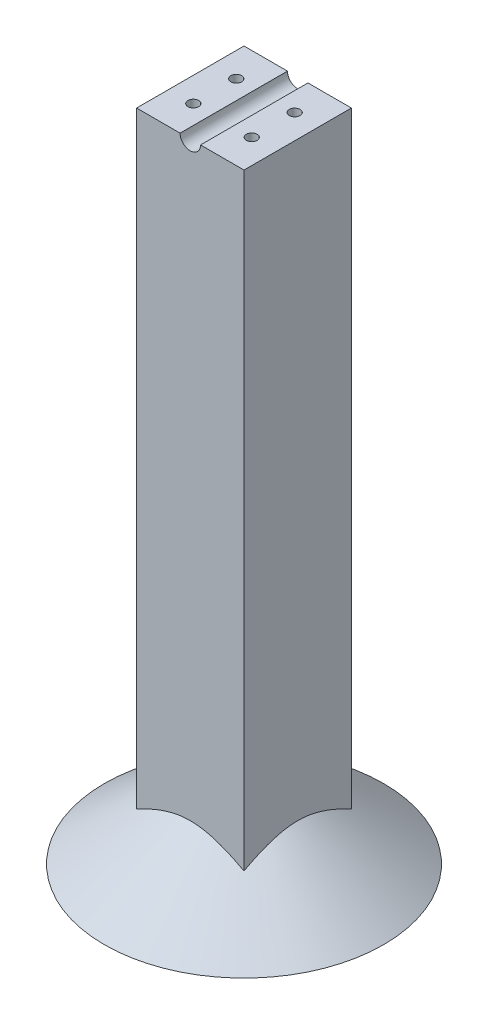
ISO-10303-21;
HEADER;
FILE_DESCRIPTION(('STEP AP214'),'2;1');
FILE_NAME('part.step','',(''),(''),'','','');
FILE_SCHEMA(('AUTOMOTIVE_DESIGN { 1 0 10303 214 1 1 1 1 }'));
ENDSEC;
DATA;
#1=APPLICATION_CONTEXT('core data for automotive mechanical design processes');
#2=APPLICATION_PROTOCOL_DEFINITION('international standard','automotive_design',2000,#1);
#3=PRODUCT_CONTEXT('',#1,'mechanical');
#4=PRODUCT('Part','Part','',(#3));
#5=PRODUCT_RELATED_PRODUCT_CATEGORY('part','',(#4));
#6=PRODUCT_DEFINITION_FORMATION('','',#4);
#7=PRODUCT_DEFINITION_CONTEXT('part definition',#1,'design');
#8=PRODUCT_DEFINITION('design','',#6,#7);
#9=PRODUCT_DEFINITION_SHAPE('','',#8);
#10=(LENGTH_UNIT() NAMED_UNIT(*) SI_UNIT(.MILLI.,.METRE.));
#11=(NAMED_UNIT(*) PLANE_ANGLE_UNIT() SI_UNIT($,.RADIAN.));
#12=(NAMED_UNIT(*) SI_UNIT($,.STERADIAN.) SOLID_ANGLE_UNIT());
#13=UNCERTAINTY_MEASURE_WITH_UNIT(LENGTH_MEASURE(1.E-05),#10,'distance_accuracy_value','');
#14=(GEOMETRIC_REPRESENTATION_CONTEXT(3) GLOBAL_UNCERTAINTY_ASSIGNED_CONTEXT((#13)) GLOBAL_UNIT_ASSIGNED_CONTEXT((#10,
#11,#12)) REPRESENTATION_CONTEXT('',''));
#15=CARTESIAN_POINT('',(0.,0.,0.));
#16=DIRECTION('',(0.,0.,1.));
#17=DIRECTION('',(1.,0.,0.));
#18=AXIS2_PLACEMENT_3D('',#15,#16,#17);
#19=CARTESIAN_POINT('',(0.,0.,0.));
#20=DIRECTION('',(0.,1.,0.));
#21=DIRECTION('',(0.,0.,1.));
#22=AXIS2_PLACEMENT_3D('',#19,#20,#21);
#23=PLANE('',#22);
#24=CARTESIAN_POINT('',(-6.8,0.,5.));
#25=DIRECTION('',(0.,1.,0.));
#26=DIRECTION('',(0.,0.,1.));
#27=AXIS2_PLACEMENT_3D('',#24,#25,#26);
#28=CIRCLE('',#27,1.25);
#29=CARTESIAN_POINT('',(-6.8,0.,6.25));
#30=VERTEX_POINT('',#29);
#31=EDGE_CURVE('E113',#30,#30,#28,.T.);
#32=ORIENTED_EDGE('',*,*,#31,.F.);
#33=EDGE_LOOP('',(#32));
#34=FACE_BOUND('',#33,.T.);
#35=CARTESIAN_POINT('',(-6.8,0.,-5.));
#36=DIRECTION('',(0.,1.,0.));
#37=DIRECTION('',(0.,0.,1.));
#38=AXIS2_PLACEMENT_3D('',#35,#36,#37);
#39=CIRCLE('',#38,1.25);
#40=CARTESIAN_POINT('',(-6.8,0.,-3.75));
#41=VERTEX_POINT('',#40);
#42=EDGE_CURVE('E112',#41,#41,#39,.T.);
#43=ORIENTED_EDGE('',*,*,#42,.F.);
#44=EDGE_LOOP('',(#43));
#45=FACE_BOUND('',#44,.T.);
#46=DIRECTION('',(0.,0.,1.));
#47=VECTOR('',#46,1.);
#48=CARTESIAN_POINT('',(-2.38125,0.,-32.501));
#49=LINE('',#48,#47);
#50=CARTESIAN_POINT('',(-2.38125,0.,12.5));
#51=VERTEX_POINT('',#50);
#52=CARTESIAN_POINT('',(-2.38125,0.,-12.5));
#53=VERTEX_POINT('',#52);
#54=EDGE_CURVE('E54',#51,#53,#49,.F.);
#55=ORIENTED_EDGE('',*,*,#54,.T.);
#56=DIRECTION('',(-1.,0.,0.));
#57=VECTOR('',#56,1.);
#58=CARTESIAN_POINT('',(-12.5,0.,-12.5));
#59=LINE('',#58,#57);
#60=CARTESIAN_POINT('',(-12.5,0.,-12.5));
#61=VERTEX_POINT('',#60);
#62=EDGE_CURVE('E195',#53,#61,#59,.T.);
#63=ORIENTED_EDGE('',*,*,#62,.T.);
#64=DIRECTION('',(0.,0.,1.));
#65=VECTOR('',#64,1.);
#66=CARTESIAN_POINT('',(-12.5,0.,-12.5));
#67=LINE('',#66,#65);
#68=CARTESIAN_POINT('',(-12.5,0.,12.5));
#69=VERTEX_POINT('',#68);
#70=EDGE_CURVE('E208',#61,#69,#67,.T.);
#71=ORIENTED_EDGE('',*,*,#70,.T.);
#72=DIRECTION('',(1.,0.,0.));
#73=VECTOR('',#72,1.);
#74=CARTESIAN_POINT('',(-12.5,0.,12.5));
#75=LINE('',#74,#73);
#76=EDGE_CURVE('E198',#69,#51,#75,.T.);
#77=ORIENTED_EDGE('',*,*,#76,.T.);
#78=EDGE_LOOP('',(#55,#63,#71,#77));
#79=FACE_BOUND('',#78,.T.);
#80=ADVANCED_FACE('F33',(#34,#45,#79),#23,.T.);
#81=CARTESIAN_POINT('',(0.,-152.4,0.));
#82=DIRECTION('',(0.,1.,0.));
#83=DIRECTION('',(0.,0.,1.));
#84=AXIS2_PLACEMENT_3D('',#81,#82,#83);
#85=PLANE('',#84);
#86=CARTESIAN_POINT('',(0.,-152.4,0.));
#87=DIRECTION('',(0.,-1.,0.));
#88=DIRECTION('',(1.,0.,0.));
#89=AXIS2_PLACEMENT_3D('',#86,#87,#88);
#90=CIRCLE('',#89,32.5);
#91=CARTESIAN_POINT('',(32.5,-152.4,0.));
#92=VERTEX_POINT('',#91);
#93=EDGE_CURVE('E144',#92,#92,#90,.T.);
#94=ORIENTED_EDGE('',*,*,#93,.T.);
#95=EDGE_LOOP('',(#94));
#96=FACE_BOUND('',#95,.T.);
#97=ADVANCED_FACE('F182',(#96),#85,.F.);
#98=CARTESIAN_POINT('',(0.,-152.4,0.));
#99=DIRECTION('',(0.,-1.,0.));
#100=DIRECTION('',(1.,0.,0.));
#101=AXIS2_PLACEMENT_3D('',#98,#99,#100);
#102=CONICAL_SURFACE('',#101,32.5,0.927295218001613);
#103=CARTESIAN_POINT('',(-26.2243010295689,-149.813293417001,-12.5));
#104=CARTESIAN_POINT('',(-25.6187512116304,-149.403376552686,-12.5));
#105=CARTESIAN_POINT('',(-25.0120225593732,-148.995186626278,-12.5));
#106=CARTESIAN_POINT('',(-23.7956278677155,-148.183179999635,-12.5));
#107=CARTESIAN_POINT('',(-23.1859617631345,-147.779363397094,-12.5));
#108=CARTESIAN_POINT('',(-21.9616062426003,-146.976035189606,-12.5));
#109=CARTESIAN_POINT('',(-21.3469080638742,-146.576536918876,-12.5));
#110=CARTESIAN_POINT('',(-20.1132289532189,-145.784176594127,-12.5));
#111=CARTESIAN_POINT('',(-19.494247956235,-145.391314641224,-12.5));
#112=CARTESIAN_POINT('',(-18.1998631925214,-144.581950567522,-12.5));
#113=CARTESIAN_POINT('',(-17.5240101446196,-144.166165430351,-12.5));
#114=CARTESIAN_POINT('',(-16.1645880498756,-143.347399644077,-12.5));
#115=CARTESIAN_POINT('',(-15.481019345862,-142.944418429071,-12.5));
#116=CARTESIAN_POINT('',(-14.448669543169,-142.353044747635,-12.5));
#117=CARTESIAN_POINT('',(-14.1035788935266,-142.158206969668,-12.5));
#118=CARTESIAN_POINT('',(-13.410615276582,-141.773549977645,-12.5));
#119=CARTESIAN_POINT('',(-13.0627423671592,-141.583730659542,-12.5));
#120=CARTESIAN_POINT('',(-12.3637465546641,-141.209909997568,-12.5));
#121=CARTESIAN_POINT('',(-12.0126227234552,-141.025910385861,-12.5));
#122=CARTESIAN_POINT('',(-11.3068250622317,-140.664840633347,-12.5));
#123=CARTESIAN_POINT('',(-10.9521512661581,-140.487770426368,-12.5));
#124=CARTESIAN_POINT('',(-10.2449580051148,-140.144815859692,-12.5));
#125=CARTESIAN_POINT('',(-9.8925067099828,-139.97879133725,-12.5));
#126=CARTESIAN_POINT('',(-9.18329902465731,-139.656131388694,-12.5));
#127=CARTESIAN_POINT('',(-8.82654246116981,-139.499496342045,-12.5));
#128=CARTESIAN_POINT('',(-8.10850898288185,-139.197473248927,-12.5));
#129=CARTESIAN_POINT('',(-7.7472346546791,-139.05207908093,-12.5));
#130=CARTESIAN_POINT('',(-7.01965331642115,-138.774555219264,-12.5));
#131=CARTESIAN_POINT('',(-6.65334699798655,-138.642423723043,-12.5));
#132=CARTESIAN_POINT('',(-5.92364415918834,-138.396599989365,-12.5));
#133=CARTESIAN_POINT('',(-5.56036469907021,-138.282562462058,-12.5));
#134=CARTESIAN_POINT('',(-4.82871848674797,-138.071989744562,-12.5));
#135=CARTESIAN_POINT('',(-4.46035164192054,-137.975454873487,-12.5));
#136=CARTESIAN_POINT('',(-3.71922708738284,-137.802617718969,-12.5));
#137=CARTESIAN_POINT('',(-3.34647383691921,-137.726296477168,-12.5));
#138=CARTESIAN_POINT('',(-2.59703764339054,-137.596300581269,-12.5));
#139=CARTESIAN_POINT('',(-2.22035532546225,-137.5426223792,-12.5));
#140=CARTESIAN_POINT('',(-1.5657484281248,-137.471029043301,-12.5));
#141=CARTESIAN_POINT('',(-1.28844257018611,-137.447382698575,-12.5));
#142=CARTESIAN_POINT('',(-0.733004832204488,-137.41381118692,-12.5));
#143=CARTESIAN_POINT('',(-0.454873001700603,-137.403885213105,-12.5));
#144=CARTESIAN_POINT('',(0.101523565876558,-137.397987530731,-12.5));
#145=CARTESIAN_POINT('',(0.379788295463824,-137.402015111884,-12.5));
#146=CARTESIAN_POINT('',(0.935773745675558,-137.423927493208,-12.5));
#147=CARTESIAN_POINT('',(1.21349445518911,-137.441812573501,-12.5));
#148=CARTESIAN_POINT('',(1.76953708093603,-137.491192788868,-12.5));
#149=CARTESIAN_POINT('',(2.04785115151611,-137.522775721608,-12.5));
#150=CARTESIAN_POINT('',(2.60270734078541,-137.59888068357,-12.5));
#151=CARTESIAN_POINT('',(2.87924936477604,-137.6434033985,-12.5));
#152=CARTESIAN_POINT('',(3.43014486478779,-137.744506420731,-12.5));
#153=CARTESIAN_POINT('',(3.70449806932452,-137.801088200347,-12.5));
#154=CARTESIAN_POINT('',(4.2506787965993,-137.925299220085,-12.5));
#155=CARTESIAN_POINT('',(4.52250623576825,-137.992928824377,-12.5));
#156=CARTESIAN_POINT('',(5.3725184815032,-138.22116959061,-12.5));
#157=CARTESIAN_POINT('',(5.94592236930663,-138.399739499594,-12.5));
#158=CARTESIAN_POINT('',(7.08031212499417,-138.792849422449,-12.5));
#159=CARTESIAN_POINT('',(7.64129099825037,-139.007409141905,-12.5));
#160=CARTESIAN_POINT('',(8.75292528656359,-139.464584723849,-12.5));
#161=CARTESIAN_POINT('',(9.30355741623722,-139.707256692855,-12.5));
#162=CARTESIAN_POINT('',(10.3947837859339,-140.213779384715,-12.5));
#163=CARTESIAN_POINT('',(10.9353797820099,-140.477626358678,-12.5));
#164=CARTESIAN_POINT('',(12.0179456868848,-141.026616792678,-12.5));
#165=CARTESIAN_POINT('',(12.5597629721002,-141.312059529576,-12.5));
#166=CARTESIAN_POINT('',(13.6362328728646,-141.896124992603,-12.5));
#167=CARTESIAN_POINT('',(14.1708852732594,-142.194748113375,-12.5));
#168=CARTESIAN_POINT('',(15.2335461330669,-142.801954283345,-12.5));
#169=CARTESIAN_POINT('',(15.7615624690208,-143.110523586742,-12.5));
#170=CARTESIAN_POINT('',(16.5498850503547,-143.579558933012,-12.5));
#171=CARTESIAN_POINT('',(16.8120395703601,-143.736932624097,-12.5));
#172=CARTESIAN_POINT('',(17.3352237014495,-144.05353868284,-12.5));
#173=CARTESIAN_POINT('',(17.5962533139833,-144.2127710481,-12.5));
#174=CARTESIAN_POINT('',(18.3937814834394,-144.702784494311,-12.5));
#175=CARTESIAN_POINT('',(18.9286167664688,-145.036274191027,-12.5));
#176=CARTESIAN_POINT('',(19.994663541332,-145.709002639267,-12.5));
#177=CARTESIAN_POINT('',(20.5258749706794,-146.048241489574,-12.5));
#178=CARTESIAN_POINT('',(21.585280960242,-146.731468115516,-12.5));
#179=CARTESIAN_POINT('',(22.1134753227495,-147.075456197433,-12.5));
#180=CARTESIAN_POINT('',(23.1672792042188,-147.767359321987,-12.5));
#181=CARTESIAN_POINT('',(23.6928887361757,-148.115274344854,-12.5));
#182=CARTESIAN_POINT('',(24.7420235450092,-148.814478092265,-12.5));
#183=CARTESIAN_POINT('',(25.2655483409483,-149.165767537957,-12.5));
#184=CARTESIAN_POINT('',(26.3107101628304,-149.87114469359,-12.5));
#185=CARTESIAN_POINT('',(26.8323471829574,-150.225232412141,-12.5));
#186=CARTESIAN_POINT('',(28.3948353437132,-151.291064819705,-12.5));
#187=CARTESIAN_POINT('',(29.4332561382384,-152.006373780035,-12.5));
#188=CARTESIAN_POINT('',(30.987880793138,-153.085107365635,-12.5));
#189=CARTESIAN_POINT('',(31.505926814931,-153.445885517054,-12.5));
#190=CARTESIAN_POINT('',(32.540927011479,-154.168997982742,-12.5));
#191=CARTESIAN_POINT('',(33.0578811934971,-154.531332286609,-12.5));
#192=CARTESIAN_POINT('',(34.6073215985525,-155.620378925845,-12.5));
#193=CARTESIAN_POINT('',(35.6383760411644,-156.349128289092,-12.5));
#194=CARTESIAN_POINT('',(37.6973348210738,-157.810755974206,-12.5));
#195=CARTESIAN_POINT('',(38.7252395778549,-158.543633705736,-12.5));
#196=CARTESIAN_POINT('',(40.7786318875631,-160.012761068068,-12.5));
#197=CARTESIAN_POINT('',(41.8041194461696,-160.749010690934,-12.5));
#198=CARTESIAN_POINT('',(44.6468585445529,-162.795660326505,-12.5));
#199=CARTESIAN_POINT('',(46.4620128847816,-164.108972754611,-12.5));
#200=CARTESIAN_POINT('',(50.0880221968464,-166.741672074124,-12.5));
#201=CARTESIAN_POINT('',(51.8988769853552,-168.061059217742,-12.5));
#202=CARTESIAN_POINT('',(55.5135941439043,-170.701526953499,-12.5));
#203=CARTESIAN_POINT('',(57.3174632269076,-172.022598358603,-12.5));
#204=CARTESIAN_POINT('',(60.0213844907413,-174.006680293497,-12.5));
#205=CARTESIAN_POINT('',(60.9223566757276,-174.668437810542,-12.5));
#206=CARTESIAN_POINT('',(62.7237573247778,-175.992691809218,-12.5));
#207=CARTESIAN_POINT('',(63.6241857890416,-176.655188290576,-12.5));
#208=CARTESIAN_POINT('',(64.5243774932075,-177.31800636118,-12.5));
#209=B_SPLINE_CURVE_WITH_KNOTS('',3,(#103,#104,#105,#106,#107,#108,#109,#110,#111,#112,#113,
#114,#115,#116,#117,#118,#119,#120,#121,#122,#123,#124,#125,#126,#127,#128,#129,#130,#131,#132,
#133,#134,#135,#136,#137,#138,#139,#140,#141,#142,#143,#144,#145,#146,#147,#148,#149,#150,#151,
#152,#153,#154,#155,#156,#157,#158,#159,#160,#161,#162,#163,#164,#165,#166,#167,#168,#169,#170,
#171,#172,#173,#174,#175,#176,#177,#178,#179,#180,#181,#182,#183,#184,#185,#186,#187,#188,#189,
#190,#191,#192,#193,#194,#195,#196,#197,#198,#199,#200,#201,#202,#203,#204,#205,#206,#207,#208),
.UNSPECIFIED.,.F.,.F.,(4,2,2,2,2,2,2,2,2,2,2,2,2,2,2,2,2,2,2,2,2,2,2,2,2,2,2,2,2,2,2,2,2,2,2,2,
2,2,2,2,2,2,2,2,2,2,2,2,2,2,2,2,4),(0.,2.19375066545931,4.38755023532075,6.58685090202919,
8.78618504907016,11.1666102207505,13.5469300364471,14.7357805006485,15.9246062971454,
17.1137826652816,18.302947674619,19.4716238522745,20.6403472289768,21.808429595647,
22.9763529907109,24.1182501180169,25.2601680627207,26.4010111794304,27.5416754693516,
28.3762996682862,29.2108747814153,30.0454074122024,30.8799569131623,31.7199364729694,
32.559960553259,33.4000872525729,34.2402416505848,36.0402088009871,37.8411647279903,
39.6457790286701,41.4500745364958,43.2870661192099,45.124112741852,46.9587210704761,
47.8760062998232,48.7932903466134,50.6841068946071,52.5749559640372,54.4659275507038,
56.3568896207485,58.2482652206407,60.1396466426372,63.9224363612884,65.8163179482204,
67.7101868967938,71.4979600105791,75.2852045864285,79.0724402551779,85.7937426545824,
92.5153266720539,99.2229705838965,102.576634731661,105.930297646652),.UNSPECIFIED.);
#210=CARTESIAN_POINT('',(-12.5,-141.283252147248,-12.5));
#211=VERTEX_POINT('',#210);
#212=CARTESIAN_POINT('',(12.5,-141.283252147248,-12.5));
#213=VERTEX_POINT('',#212);
#214=EDGE_CURVE('E11',#211,#213,#209,.T.);
#215=ORIENTED_EDGE('',*,*,#214,.T.);
#216=CARTESIAN_POINT('',(12.5,-149.813293417001,-26.2243010295689));
#217=CARTESIAN_POINT('',(12.5,-149.403376552686,-25.6187512116304));
#218=CARTESIAN_POINT('',(12.5,-148.995186626278,-25.0120225593732));
#219=CARTESIAN_POINT('',(12.5,-148.183179999635,-23.7956278677155));
#220=CARTESIAN_POINT('',(12.5,-147.779363397094,-23.1859617631345));
#221=CARTESIAN_POINT('',(12.5,-146.976035189606,-21.9616062426003));
#222=CARTESIAN_POINT('',(12.5,-146.576536918876,-21.3469080638742));
#223=CARTESIAN_POINT('',(12.5,-145.784176594127,-20.1132289532189));
#224=CARTESIAN_POINT('',(12.5,-145.391314641224,-19.494247956235));
#225=CARTESIAN_POINT('',(12.5,-144.581950567522,-18.1998631925214));
#226=CARTESIAN_POINT('',(12.5,-144.166165430351,-17.5240101446196));
#227=CARTESIAN_POINT('',(12.5,-143.347399644077,-16.1645880498756));
#228=CARTESIAN_POINT('',(12.5,-142.944418429071,-15.481019345862));
#229=CARTESIAN_POINT('',(12.5,-142.353044747635,-14.448669543169));
#230=CARTESIAN_POINT('',(12.5,-142.158206969668,-14.1035788935266));
#231=CARTESIAN_POINT('',(12.5,-141.773549977645,-13.410615276582));
#232=CARTESIAN_POINT('',(12.5,-141.583730659542,-13.0627423671592));
#233=CARTESIAN_POINT('',(12.5,-141.209909997568,-12.3637465546641));
#234=CARTESIAN_POINT('',(12.5,-141.025910385861,-12.0126227234552));
#235=CARTESIAN_POINT('',(12.5,-140.664840633347,-11.3068250622317));
#236=CARTESIAN_POINT('',(12.5,-140.487770426368,-10.952151266158));
#237=CARTESIAN_POINT('',(12.5,-140.144815859692,-10.2449580051148));
#238=CARTESIAN_POINT('',(12.5,-139.97879133725,-9.89250670998279));
#239=CARTESIAN_POINT('',(12.5,-139.656131388694,-9.18329902465729));
#240=CARTESIAN_POINT('',(12.5,-139.499496342045,-8.8265424611698));
#241=CARTESIAN_POINT('',(12.5,-139.197473248927,-8.10850898288184));
#242=CARTESIAN_POINT('',(12.5,-139.05207908093,-7.7472346546791));
#243=CARTESIAN_POINT('',(12.5,-138.774555219264,-7.01965331642114));
#244=CARTESIAN_POINT('',(12.5,-138.642423723043,-6.65334699798654));
#245=CARTESIAN_POINT('',(12.5,-138.396599989365,-5.92364415918834));
#246=CARTESIAN_POINT('',(12.5,-138.282562462058,-5.56036469907021));
#247=CARTESIAN_POINT('',(12.5,-138.071989744562,-4.82871848674797));
#248=CARTESIAN_POINT('',(12.5,-137.975454873487,-4.46035164192054));
#249=CARTESIAN_POINT('',(12.5,-137.802617718969,-3.71922708738284));
#250=CARTESIAN_POINT('',(12.5,-137.726296477168,-3.34647383691921));
#251=CARTESIAN_POINT('',(12.5,-137.596300581269,-2.59703764339054));
#252=CARTESIAN_POINT('',(12.5,-137.5426223792,-2.22035532546225));
#253=CARTESIAN_POINT('',(12.5,-137.471029043301,-1.5657484281248));
#254=CARTESIAN_POINT('',(12.5,-137.447382698575,-1.28844257018612));
#255=CARTESIAN_POINT('',(12.5,-137.41381118692,-0.733004832204495));
#256=CARTESIAN_POINT('',(12.5,-137.403885213105,-0.454873001700607));
#257=CARTESIAN_POINT('',(12.5,-137.397987530731,0.101523565876554));
#258=CARTESIAN_POINT('',(12.5,-137.402015111884,0.37978829546382));
#259=CARTESIAN_POINT('',(12.5,-137.423927493208,0.935773745675554));
#260=CARTESIAN_POINT('',(12.5,-137.441812573501,1.2134944551891));
#261=CARTESIAN_POINT('',(12.5,-137.491192788868,1.76953708093602));
#262=CARTESIAN_POINT('',(12.5,-137.522775721608,2.0478511515161));
#263=CARTESIAN_POINT('',(12.5,-137.59888068357,2.6027073407854));
#264=CARTESIAN_POINT('',(12.5,-137.6434033985,2.87924936477603));
#265=CARTESIAN_POINT('',(12.5,-137.744506420731,3.43014486478778));
#266=CARTESIAN_POINT('',(12.5,-137.801088200347,3.70449806932451));
#267=CARTESIAN_POINT('',(12.5,-137.925299220085,4.2506787965993));
#268=CARTESIAN_POINT('',(12.5,-137.992928824377,4.52250623576825));
#269=CARTESIAN_POINT('',(12.5,-138.22116959061,5.37251848150319));
#270=CARTESIAN_POINT('',(12.5,-138.399739499594,5.94592236930663));
#271=CARTESIAN_POINT('',(12.5,-138.792849422449,7.08031212499417));
#272=CARTESIAN_POINT('',(12.5,-139.007409141905,7.64129099825037));
#273=CARTESIAN_POINT('',(12.5,-139.464584723849,8.75292528656358));
#274=CARTESIAN_POINT('',(12.5,-139.707256692855,9.3035574162372));
#275=CARTESIAN_POINT('',(12.5,-140.213779384715,10.3947837859339));
#276=CARTESIAN_POINT('',(12.5,-140.477626358678,10.9353797820098));
#277=CARTESIAN_POINT('',(12.5,-141.026616792678,12.0179456868848));
#278=CARTESIAN_POINT('',(12.5,-141.312059529576,12.5597629721001));
#279=CARTESIAN_POINT('',(12.5,-141.896124992603,13.6362328728645));
#280=CARTESIAN_POINT('',(12.5,-142.194748113375,14.1708852732594));
#281=CARTESIAN_POINT('',(12.5,-142.801954283345,15.2335461330669));
#282=CARTESIAN_POINT('',(12.5,-143.110523586742,15.7615624690208));
#283=CARTESIAN_POINT('',(12.5,-143.579558933012,16.5498850503547));
#284=CARTESIAN_POINT('',(12.5,-143.736932624097,16.8120395703601));
#285=CARTESIAN_POINT('',(12.5,-144.05353868284,17.3352237014495));
#286=CARTESIAN_POINT('',(12.5,-144.2127710481,17.5962533139833));
#287=CARTESIAN_POINT('',(12.5,-144.702784494311,18.3937814834394));
#288=CARTESIAN_POINT('',(12.5,-145.036274191027,18.9286167664688));
#289=CARTESIAN_POINT('',(12.5,-145.709002639267,19.994663541332));
#290=CARTESIAN_POINT('',(12.5,-146.048241489574,20.5258749706794));
#291=CARTESIAN_POINT('',(12.5,-146.731468115516,21.585280960242));
#292=CARTESIAN_POINT('',(12.5,-147.075456197433,22.1134753227495));
#293=CARTESIAN_POINT('',(12.5,-147.767359321987,23.1672792042187));
#294=CARTESIAN_POINT('',(12.5,-148.115274344854,23.6928887361757));
#295=CARTESIAN_POINT('',(12.5,-148.814478092265,24.7420235450092));
#296=CARTESIAN_POINT('',(12.5,-149.165767537957,25.2655483409483));
#297=CARTESIAN_POINT('',(12.5,-149.87114469359,26.3107101628303));
#298=CARTESIAN_POINT('',(12.5,-150.225232412141,26.8323471829574));
#299=CARTESIAN_POINT('',(12.5,-151.291064819705,28.3948353437132));
#300=CARTESIAN_POINT('',(12.5,-152.006373780035,29.4332561382384));
#301=CARTESIAN_POINT('',(12.5,-153.085107365635,30.987880793138));
#302=CARTESIAN_POINT('',(12.5,-153.445885517054,31.505926814931));
#303=CARTESIAN_POINT('',(12.5,-154.168997982742,32.540927011479));
#304=CARTESIAN_POINT('',(12.5,-154.531332286609,33.0578811934971));
#305=CARTESIAN_POINT('',(12.5,-155.620378925845,34.6073215985525));
#306=CARTESIAN_POINT('',(12.5,-156.349128289092,35.6383760411644));
#307=CARTESIAN_POINT('',(12.5,-157.810755974206,37.6973348210738));
#308=CARTESIAN_POINT('',(12.5,-158.543633705736,38.7252395778548));
#309=CARTESIAN_POINT('',(12.5,-160.012761068068,40.7786318875631));
#310=CARTESIAN_POINT('',(12.5,-160.749010690934,41.8041194461696));
#311=CARTESIAN_POINT('',(12.5,-162.795660326505,44.6468585445529));
#312=CARTESIAN_POINT('',(12.5,-164.10897275461,46.4620128847816));
#313=CARTESIAN_POINT('',(12.5,-166.741672074124,50.0880221968464));
#314=CARTESIAN_POINT('',(12.5,-168.061059217742,51.8988769853552));
#315=CARTESIAN_POINT('',(12.5,-170.701526953499,55.5135941439043));
#316=CARTESIAN_POINT('',(12.5,-172.022598358603,57.3174632269076));
#317=CARTESIAN_POINT('',(12.5,-174.006680293497,60.0213844907413));
#318=CARTESIAN_POINT('',(12.5,-174.668437810542,60.9223566757276));
#319=CARTESIAN_POINT('',(12.5,-175.992691809218,62.7237573247778));
#320=CARTESIAN_POINT('',(12.5,-176.655188290576,63.6241857890416));
#321=CARTESIAN_POINT('',(12.5,-177.31800636118,64.5243774932075));
#322=B_SPLINE_CURVE_WITH_KNOTS('',3,(#216,#217,#218,#219,#220,#221,#222,#223,#224,#225,#226,
#227,#228,#229,#230,#231,#232,#233,#234,#235,#236,#237,#238,#239,#240,#241,#242,#243,#244,#245,
#246,#247,#248,#249,#250,#251,#252,#253,#254,#255,#256,#257,#258,#259,#260,#261,#262,#263,#264,
#265,#266,#267,#268,#269,#270,#271,#272,#273,#274,#275,#276,#277,#278,#279,#280,#281,#282,#283,
#284,#285,#286,#287,#288,#289,#290,#291,#292,#293,#294,#295,#296,#297,#298,#299,#300,#301,#302,
#303,#304,#305,#306,#307,#308,#309,#310,#311,#312,#313,#314,#315,#316,#317,#318,#319,#320,#321),
.UNSPECIFIED.,.F.,.F.,(4,2,2,2,2,2,2,2,2,2,2,2,2,2,2,2,2,2,2,2,2,2,2,2,2,2,2,2,2,2,2,2,2,2,2,2,
2,2,2,2,2,2,2,2,2,2,2,2,2,2,2,2,4),(0.,2.19375066545931,4.38755023532075,6.58685090202917,
8.78618504907016,11.1666102207505,13.5469300364471,14.7357805006485,15.9246062971454,
17.1137826652816,18.302947674619,19.4716238522745,20.6403472289768,21.8084295956471,
22.9763529907109,24.1182501180169,25.2601680627207,26.4010111794304,27.5416754693516,
28.3762996682862,29.2108747814153,30.0454074122024,30.8799569131623,31.7199364729694,
32.559960553259,33.4000872525729,34.2402416505848,36.0402088009871,37.8411647279903,
39.6457790286701,41.4500745364958,43.2870661192099,45.124112741852,46.9587210704761,
47.8760062998232,48.7932903466134,50.6841068946071,52.5749559640372,54.4659275507038,
56.3568896207485,58.2482652206406,60.1396466426372,63.9224363612884,65.8163179482204,
67.7101868967938,71.4979600105791,75.2852045864285,79.0724402551779,85.7937426545824,
92.5153266720539,99.2229705838965,102.576634731661,105.930297646652),.UNSPECIFIED.);
#323=CARTESIAN_POINT('',(12.5,-141.283252147248,12.5));
#324=VERTEX_POINT('',#323);
#325=EDGE_CURVE('E61',#213,#324,#322,.T.);
#326=ORIENTED_EDGE('',*,*,#325,.T.);
#327=CARTESIAN_POINT('',(-26.2243010295689,-149.813293417001,12.5));
#328=CARTESIAN_POINT('',(-25.6187512116304,-149.403376552686,12.5));
#329=CARTESIAN_POINT('',(-25.0120225593732,-148.995186626278,12.5));
#330=CARTESIAN_POINT('',(-23.7956278677155,-148.183179999635,12.5));
#331=CARTESIAN_POINT('',(-23.1859617631345,-147.779363397094,12.5));
#332=CARTESIAN_POINT('',(-21.9616062426003,-146.976035189606,12.5));
#333=CARTESIAN_POINT('',(-21.3469080638742,-146.576536918876,12.5));
#334=CARTESIAN_POINT('',(-20.1132289532189,-145.784176594127,12.5));
#335=CARTESIAN_POINT('',(-19.494247956235,-145.391314641224,12.5));
#336=CARTESIAN_POINT('',(-18.1998631925214,-144.581950567522,12.5));
#337=CARTESIAN_POINT('',(-17.5240101446196,-144.166165430351,12.5));
#338=CARTESIAN_POINT('',(-16.1645880498755,-143.347399644077,12.5));
#339=CARTESIAN_POINT('',(-15.481019345862,-142.944418429071,12.5));
#340=CARTESIAN_POINT('',(-14.448669543169,-142.353044747635,12.5));
#341=CARTESIAN_POINT('',(-14.1035788935266,-142.158206969668,12.5));
#342=CARTESIAN_POINT('',(-13.410615276582,-141.773549977645,12.5));
#343=CARTESIAN_POINT('',(-13.0627423671592,-141.583730659542,12.5));
#344=CARTESIAN_POINT('',(-12.3637465546641,-141.209909997568,12.5));
#345=CARTESIAN_POINT('',(-12.0126227234552,-141.025910385861,12.5));
#346=CARTESIAN_POINT('',(-11.3068250622317,-140.664840633347,12.5));
#347=CARTESIAN_POINT('',(-10.952151266158,-140.487770426368,12.5));
#348=CARTESIAN_POINT('',(-10.2449580051148,-140.144815859692,12.5));
#349=CARTESIAN_POINT('',(-9.89250670998278,-139.97879133725,12.5));
#350=CARTESIAN_POINT('',(-9.18329902465728,-139.656131388694,12.5));
#351=CARTESIAN_POINT('',(-8.82654246116977,-139.499496342045,12.5));
#352=CARTESIAN_POINT('',(-8.10850898288182,-139.197473248927,12.5));
#353=CARTESIAN_POINT('',(-7.74723465467907,-139.05207908093,12.5));
#354=CARTESIAN_POINT('',(-7.01965331642112,-138.774555219264,12.5));
#355=CARTESIAN_POINT('',(-6.65334699798653,-138.642423723043,12.5));
#356=CARTESIAN_POINT('',(-5.92364415918833,-138.396599989365,12.5));
#357=CARTESIAN_POINT('',(-5.56036469907019,-138.282562462058,12.5));
#358=CARTESIAN_POINT('',(-4.82871848674796,-138.071989744562,12.5));
#359=CARTESIAN_POINT('',(-4.46035164192052,-137.975454873487,12.5));
#360=CARTESIAN_POINT('',(-3.71922708738283,-137.802617718969,12.5));
#361=CARTESIAN_POINT('',(-3.3464738369192,-137.726296477168,12.5));
#362=CARTESIAN_POINT('',(-2.59703764339053,-137.596300581269,12.5));
#363=CARTESIAN_POINT('',(-2.22035532546224,-137.5426223792,12.5));
#364=CARTESIAN_POINT('',(-1.56574842812478,-137.471029043301,12.5));
#365=CARTESIAN_POINT('',(-1.2884425701861,-137.447382698575,12.5));
#366=CARTESIAN_POINT('',(-0.733004832204479,-137.41381118692,12.5));
#367=CARTESIAN_POINT('',(-0.454873001700592,-137.403885213105,12.5));
#368=CARTESIAN_POINT('',(0.101523565876569,-137.397987530731,12.5));
#369=CARTESIAN_POINT('',(0.379788295463835,-137.402015111884,12.5));
#370=CARTESIAN_POINT('',(0.935773745675569,-137.423927493208,12.5));
#371=CARTESIAN_POINT('',(1.21349445518912,-137.441812573501,12.5));
#372=CARTESIAN_POINT('',(1.76953708093604,-137.491192788868,12.5));
#373=CARTESIAN_POINT('',(2.04785115151612,-137.522775721608,12.5));
#374=CARTESIAN_POINT('',(2.60270734078542,-137.59888068357,12.5));
#375=CARTESIAN_POINT('',(2.87924936477605,-137.6434033985,12.5));
#376=CARTESIAN_POINT('',(3.4301448647878,-137.744506420731,12.5));
#377=CARTESIAN_POINT('',(3.70449806932453,-137.801088200347,12.5));
#378=CARTESIAN_POINT('',(4.25067879659931,-137.925299220085,12.5));
#379=CARTESIAN_POINT('',(4.52250623576826,-137.992928824377,12.5));
#380=CARTESIAN_POINT('',(5.37251848150321,-138.22116959061,12.5));
#381=CARTESIAN_POINT('',(5.94592236930664,-138.399739499594,12.5));
#382=CARTESIAN_POINT('',(7.08031212499418,-138.792849422449,12.5));
#383=CARTESIAN_POINT('',(7.6412909982504,-139.007409141905,12.5));
#384=CARTESIAN_POINT('',(8.75292528656361,-139.464584723849,12.5));
#385=CARTESIAN_POINT('',(9.30355741623724,-139.707256692855,12.5));
#386=CARTESIAN_POINT('',(10.394783785934,-140.213779384715,12.5));
#387=CARTESIAN_POINT('',(10.9353797820099,-140.477626358678,12.5));
#388=CARTESIAN_POINT('',(12.0179456868848,-141.026616792678,12.5));
#389=CARTESIAN_POINT('',(12.5597629721002,-141.312059529576,12.5));
#390=CARTESIAN_POINT('',(13.6362328728645,-141.896124992603,12.5));
#391=CARTESIAN_POINT('',(14.1708852732594,-142.194748113375,12.5));
#392=CARTESIAN_POINT('',(15.233546133067,-142.801954283345,12.5));
#393=CARTESIAN_POINT('',(15.7615624690208,-143.110523586742,12.5));
#394=CARTESIAN_POINT('',(16.5498850503547,-143.579558933012,12.5));
#395=CARTESIAN_POINT('',(16.8120395703601,-143.736932624097,12.5));
#396=CARTESIAN_POINT('',(17.3352237014495,-144.05353868284,12.5));
#397=CARTESIAN_POINT('',(17.5962533139833,-144.2127710481,12.5));
#398=CARTESIAN_POINT('',(18.3937814834394,-144.702784494311,12.5));
#399=CARTESIAN_POINT('',(18.9286167664689,-145.036274191027,12.5));
#400=CARTESIAN_POINT('',(19.994663541332,-145.709002639267,12.5));
#401=CARTESIAN_POINT('',(20.5258749706794,-146.048241489574,12.5));
#402=CARTESIAN_POINT('',(21.5852809602421,-146.731468115516,12.5));
#403=CARTESIAN_POINT('',(22.1134753227496,-147.075456197433,12.5));
#404=CARTESIAN_POINT('',(23.1672792042188,-147.767359321987,12.5));
#405=CARTESIAN_POINT('',(23.6928887361758,-148.115274344854,12.5));
#406=CARTESIAN_POINT('',(24.7420235450093,-148.814478092265,12.5));
#407=CARTESIAN_POINT('',(25.2655483409483,-149.165767537957,12.5));
#408=CARTESIAN_POINT('',(26.3107101628304,-149.87114469359,12.5));
#409=CARTESIAN_POINT('',(26.8323471829574,-150.225232412141,12.5));
#410=CARTESIAN_POINT('',(28.3948353437133,-151.291064819705,12.5));
#411=CARTESIAN_POINT('',(29.4332561382384,-152.006373780035,12.5));
#412=CARTESIAN_POINT('',(30.9878807931381,-153.085107365635,12.5));
#413=CARTESIAN_POINT('',(31.505926814931,-153.445885517054,12.5));
#414=CARTESIAN_POINT('',(32.540927011479,-154.168997982742,12.5));
#415=CARTESIAN_POINT('',(33.0578811934971,-154.531332286609,12.5));
#416=CARTESIAN_POINT('',(34.6073215985525,-155.620378925845,12.5));
#417=CARTESIAN_POINT('',(35.6383760411644,-156.349128289092,12.5));
#418=CARTESIAN_POINT('',(37.6973348210738,-157.810755974206,12.5));
#419=CARTESIAN_POINT('',(38.7252395778549,-158.543633705736,12.5));
#420=CARTESIAN_POINT('',(40.7786318875632,-160.012761068068,12.5));
#421=CARTESIAN_POINT('',(41.8041194461696,-160.749010690934,12.5));
#422=CARTESIAN_POINT('',(44.6468585445529,-162.795660326505,12.5));
#423=CARTESIAN_POINT('',(46.4620128847816,-164.108972754611,12.5));
#424=CARTESIAN_POINT('',(50.0880221968464,-166.741672074124,12.5));
#425=CARTESIAN_POINT('',(51.8988769853552,-168.061059217742,12.5));
#426=CARTESIAN_POINT('',(55.5135941439043,-170.701526953499,12.5));
#427=CARTESIAN_POINT('',(57.3174632269076,-172.022598358603,12.5));
#428=CARTESIAN_POINT('',(60.0213844907413,-174.006680293497,12.5));
#429=CARTESIAN_POINT('',(60.9223566757276,-174.668437810542,12.5));
#430=CARTESIAN_POINT('',(62.7237573247778,-175.992691809218,12.5));
#431=CARTESIAN_POINT('',(63.6241857890416,-176.655188290576,12.5));
#432=CARTESIAN_POINT('',(64.5243774932075,-177.31800636118,12.5));
#433=B_SPLINE_CURVE_WITH_KNOTS('',3,(#327,#328,#329,#330,#331,#332,#333,#334,#335,#336,#337,
#338,#339,#340,#341,#342,#343,#344,#345,#346,#347,#348,#349,#350,#351,#352,#353,#354,#355,#356,
#357,#358,#359,#360,#361,#362,#363,#364,#365,#366,#367,#368,#369,#370,#371,#372,#373,#374,#375,
#376,#377,#378,#379,#380,#381,#382,#383,#384,#385,#386,#387,#388,#389,#390,#391,#392,#393,#394,
#395,#396,#397,#398,#399,#400,#401,#402,#403,#404,#405,#406,#407,#408,#409,#410,#411,#412,#413,
#414,#415,#416,#417,#418,#419,#420,#421,#422,#423,#424,#425,#426,#427,#428,#429,#430,#431,#432),
.UNSPECIFIED.,.F.,.F.,(4,2,2,2,2,2,2,2,2,2,2,2,2,2,2,2,2,2,2,2,2,2,2,2,2,2,2,2,2,2,2,2,2,2,2,2,
2,2,2,2,2,2,2,2,2,2,2,2,2,2,2,2,4),(0.,2.19375066545931,4.38755023532075,6.58685090202919,
8.78618504907016,11.1666102207506,13.5469300364471,14.7357805006485,15.9246062971455,
17.1137826652816,18.302947674619,19.4716238522745,20.6403472289768,21.8084295956471,
22.9763529907109,24.1182501180169,25.2601680627208,26.4010111794304,27.5416754693516,
28.3762996682863,29.2108747814153,30.0454074122024,30.8799569131623,31.7199364729694,
32.559960553259,33.4000872525729,34.2402416505848,36.0402088009871,37.8411647279904,
39.6457790286702,41.4500745364958,43.2870661192099,45.124112741852,46.9587210704762,
47.8760062998232,48.7932903466135,50.6841068946071,52.5749559640372,54.4659275507038,
56.3568896207486,58.2482652206407,60.1396466426372,63.9224363612884,65.8163179482205,
67.7101868967939,71.4979600105792,75.2852045864286,79.072440255178,85.7937426545824,
92.5153266720539,99.2229705838965,102.576634731661,105.930297646652),.UNSPECIFIED.);
#434=CARTESIAN_POINT('',(-12.5,-141.283252147248,12.5));
#435=VERTEX_POINT('',#434);
#436=EDGE_CURVE('E154',#324,#435,#433,.F.);
#437=ORIENTED_EDGE('',*,*,#436,.T.);
#438=CARTESIAN_POINT('',(-12.5,-149.8132939909,-26.2243018772496));
#439=CARTESIAN_POINT('',(-12.5,-149.403377107419,-25.6187520346221));
#440=CARTESIAN_POINT('',(-12.5,-148.99518716184,-25.0120233576724));
#441=CARTESIAN_POINT('',(-12.5,-148.183180496867,-23.7956286166094));
#442=CARTESIAN_POINT('',(-12.5,-147.779363875167,-23.1859624873157));
#443=CARTESIAN_POINT('',(-12.5,-146.976035629318,-21.9616069172192));
#444=CARTESIAN_POINT('',(-12.5,-146.576537339389,-21.3469087136433));
#445=CARTESIAN_POINT('',(-12.5,-145.784176976299,-20.1132295532088));
#446=CARTESIAN_POINT('',(-12.5,-145.391315004256,-19.4942485312955));
#447=CARTESIAN_POINT('',(-12.5,-144.581950885093,-18.1998637063834));
#448=CARTESIAN_POINT('',(-12.5,-144.166165721745,-17.5240106221186));
#449=CARTESIAN_POINT('',(-12.5,-143.347399883781,-16.1645884541914));
#450=CARTESIAN_POINT('',(-12.5,-142.944418643262,-15.4810197133579));
#451=CARTESIAN_POINT('',(-12.5,-142.353044924398,-14.4486698549289));
#452=CARTESIAN_POINT('',(-12.5,-142.158207134106,-14.1035791866408));
#453=CARTESIAN_POINT('',(-12.5,-141.773550117789,-13.4106155321818));
#454=CARTESIAN_POINT('',(-12.5,-141.583730787718,-13.0627426038905));
#455=CARTESIAN_POINT('',(-12.5,-141.209910102252,-12.3637467533504));
#456=CARTESIAN_POINT('',(-12.5,-141.02591047902,-12.012622902965));
#457=CARTESIAN_POINT('',(-12.5,-140.664840704061,-11.3068252030521));
#458=CARTESIAN_POINT('',(-12.5,-140.487770486162,-10.9521513874657));
#459=CARTESIAN_POINT('',(-12.5,-140.144815895108,-10.2449580800995));
#460=CARTESIAN_POINT('',(-12.5,-139.978791359358,-9.89250675808467));
#461=CARTESIAN_POINT('',(-12.5,-139.656131385595,-9.18329901833619));
#462=CARTESIAN_POINT('',(-12.5,-139.499496327047,-8.82654242730846));
#463=CARTESIAN_POINT('',(-12.5,-139.19747321198,-8.10850889324972));
#464=CARTESIAN_POINT('',(-12.5,-139.052079033932,-7.74723453681742));
#465=CARTESIAN_POINT('',(-12.5,-138.774555154504,-7.01965314128944));
#466=CARTESIAN_POINT('',(-12.5,-138.642423650572,-6.65334679381465));
#467=CARTESIAN_POINT('',(-12.5,-138.396599905145,-5.92364389848524));
#468=CARTESIAN_POINT('',(-12.5,-138.282562373664,-5.56036441091928));
#469=CARTESIAN_POINT('',(-12.5,-138.07198965109,-4.82871814300316));
#470=CARTESIAN_POINT('',(-12.5,-137.975454779112,-4.46035127002962));
#471=CARTESIAN_POINT('',(-12.5,-137.802617626672,-3.71922665886759));
#472=CARTESIAN_POINT('',(-12.5,-137.72629638784,-3.34647337992794));
#473=CARTESIAN_POINT('',(-12.5,-137.596300502147,-2.59703712932158));
#474=CARTESIAN_POINT('',(-12.5,-137.542622307315,-2.22035478279187));
#475=CARTESIAN_POINT('',(-12.5,-137.471028989972,-1.56574785657604));
#476=CARTESIAN_POINT('',(-12.5,-137.447382654575,-1.28844199838018));
#477=CARTESIAN_POINT('',(-12.5,-137.413811161789,-0.73300426034246));
#478=CARTESIAN_POINT('',(-12.5,-137.403885197514,-0.45487243003965));
#479=CARTESIAN_POINT('',(-12.5,-137.397987534212,0.101524136686575));
#480=CARTESIAN_POINT('',(-12.5,-137.4020151249,0.379788865624024));
#481=CARTESIAN_POINT('',(-12.5,-137.423927525065,0.935774314072532));
#482=CARTESIAN_POINT('',(-12.5,-137.441812614667,1.21349502247266));
#483=CARTESIAN_POINT('',(-12.5,-137.491192848339,1.76953764617978));
#484=CARTESIAN_POINT('',(-12.5,-137.522775790102,2.04785171582814));
#485=CARTESIAN_POINT('',(-12.5,-137.598880769579,2.60270790289197));
#486=CARTESIAN_POINT('',(-12.5,-137.643403493,2.87924992560881));
#487=CARTESIAN_POINT('',(-12.5,-137.744506531569,3.43014542279945));
#488=CARTESIAN_POINT('',(-12.5,-137.80108831903,3.70449862578901));
#489=CARTESIAN_POINT('',(-12.5,-137.925299353763,4.25067934980648));
#490=CARTESIAN_POINT('',(-12.5,-137.992928965203,4.52250678726531));
#491=CARTESIAN_POINT('',(-12.5,-138.221169770573,5.37251909377998));
#492=CARTESIAN_POINT('',(-12.5,-138.399739715516,5.94592304253617));
#493=CARTESIAN_POINT('',(-12.5,-138.792849714525,7.0803129175797));
#494=CARTESIAN_POINT('',(-12.5,-139.007409474181,7.64129184923623));
#495=CARTESIAN_POINT('',(-12.5,-139.464585138968,8.7529262528138));
#496=CARTESIAN_POINT('',(-12.5,-139.70725715063,9.30355843934396));
#497=CARTESIAN_POINT('',(-12.5,-140.213779928939,10.3947849214983));
#498=CARTESIAN_POINT('',(-12.5,-140.477626946694,10.935380973176));
#499=CARTESIAN_POINT('',(-12.5,-141.026617469047,12.0179469884275));
#500=CARTESIAN_POINT('',(-12.5,-141.312060250482,12.5597643284209));
#501=CARTESIAN_POINT('',(-12.5,-141.896125802709,13.6362343383149));
#502=CARTESIAN_POINT('',(-12.5,-142.194748968145,14.1708867930612));
#503=CARTESIAN_POINT('',(-12.5,-142.801955227256,15.2335477611427));
#504=CARTESIAN_POINT('',(-12.5,-143.11052457513,15.7615641510207));
#505=CARTESIAN_POINT('',(-12.5,-143.579559988008,16.5498868131602));
#506=CARTESIAN_POINT('',(-12.5,-143.736933701278,16.8120413600872));
#507=CARTESIAN_POINT('',(-12.5,-144.053539804349,17.3352255450032));
#508=CARTESIAN_POINT('',(-12.5,-144.212772191753,17.596255184442));
#509=CARTESIAN_POINT('',(-12.5,-144.702785664327,18.3937833689331));
#510=CARTESIAN_POINT('',(-12.5,-145.036275364302,18.9286186406227));
#511=CARTESIAN_POINT('',(-12.5,-145.709003817567,19.9946653936449));
#512=CARTESIAN_POINT('',(-12.5,-146.048242669641,20.5258768124911));
#513=CARTESIAN_POINT('',(-12.5,-146.731469297951,21.5852827817089));
#514=CARTESIAN_POINT('',(-12.5,-147.075457380468,22.1134771343729));
#515=CARTESIAN_POINT('',(-12.5,-147.767360505322,23.1672809967035));
#516=CARTESIAN_POINT('',(-12.5,-148.115275527887,23.6928905193653));
#517=CARTESIAN_POINT('',(-12.5,-148.814479273942,24.7420253099949));
#518=CARTESIAN_POINT('',(-12.5,-149.165768718578,25.2655500970254));
#519=CARTESIAN_POINT('',(-12.5,-149.871145871524,26.3107119014546));
#520=CARTESIAN_POINT('',(-12.5,-150.225233588444,26.8323489130372));
#521=CARTESIAN_POINT('',(-12.5,-151.291065990418,28.3948370486025));
#522=CARTESIAN_POINT('',(-12.5,-152.006374946097,29.4332578269279));
#523=CARTESIAN_POINT('',(-12.5,-153.085108523693,30.9878824580033));
#524=CARTESIAN_POINT('',(-12.5,-153.445886672225,31.5059284718625));
#525=CARTESIAN_POINT('',(-12.5,-154.168999131874,32.5409286527207));
#526=CARTESIAN_POINT('',(-12.5,-154.531333432592,33.0578828269829));
#527=CARTESIAN_POINT('',(-12.5,-155.620380062046,34.6073232089867));
#528=CARTESIAN_POINT('',(-12.5,-156.349129418336,35.6383776365248));
#529=CARTESIAN_POINT('',(-12.5,-157.810757088961,37.6973363867872));
#530=CARTESIAN_POINT('',(-12.5,-158.543634812963,38.725241128995));
#531=CARTESIAN_POINT('',(-12.5,-160.012762159779,40.7786334098768));
#532=CARTESIAN_POINT('',(-12.5,-160.749011774661,41.8041209542301));
#533=CARTESIAN_POINT('',(-12.5,-162.795661420525,44.6468600591247));
#534=CARTESIAN_POINT('',(-12.5,-164.108973866758,46.4620144202208));
#535=CARTESIAN_POINT('',(-12.5,-166.74167322209,50.0880237742753));
#536=CARTESIAN_POINT('',(-12.5,-168.061060383399,51.8988785839065));
#537=CARTESIAN_POINT('',(-12.5,-170.701528154923,55.5135957858182));
#538=CARTESIAN_POINT('',(-12.5,-172.022599578107,57.3174648910596));
#539=CARTESIAN_POINT('',(-12.5,-174.006681539988,60.0213861883731));
#540=CARTESIAN_POINT('',(-12.5,-174.668439066015,60.922358384549));
#541=CARTESIAN_POINT('',(-12.5,-175.992693082611,62.7237590560087));
#542=CARTESIAN_POINT('',(-12.5,-176.655189572909,63.6241875314921));
#543=CARTESIAN_POINT('',(-12.5,-177.318007652435,64.5243792468902));
#544=B_SPLINE_CURVE_WITH_KNOTS('',3,(#438,#439,#440,#441,#442,#443,#444,#445,#446,#447,#448,
#449,#450,#451,#452,#453,#454,#455,#456,#457,#458,#459,#460,#461,#462,#463,#464,#465,#466,#467,
#468,#469,#470,#471,#472,#473,#474,#475,#476,#477,#478,#479,#480,#481,#482,#483,#484,#485,#486,
#487,#488,#489,#490,#491,#492,#493,#494,#495,#496,#497,#498,#499,#500,#501,#502,#503,#504,#505,
#506,#507,#508,#509,#510,#511,#512,#513,#514,#515,#516,#517,#518,#519,#520,#521,#522,#523,#524,
#525,#526,#527,#528,#529,#530,#531,#532,#533,#534,#535,#536,#537,#538,#539,#540,#541,#542,#543),
.UNSPECIFIED.,.F.,.F.,(4,2,2,2,2,2,2,2,2,2,2,2,2,2,2,2,2,2,2,2,2,2,2,2,2,2,2,2,2,2,2,2,2,2,2,2,
2,2,2,2,2,2,2,2,2,2,2,2,2,2,2,2,4),(0.,2.19375075902662,4.38755042243788,6.58685118304384,
8.78618542399955,11.1666107297394,13.5469306794479,14.7357812105352,15.9246070739152,
17.1137835090486,18.3029485853827,19.4716248529855,20.6403483196513,21.808430776088,
22.9763542608675,24.1182514703801,25.2601694973008,26.4010126957322,27.5416770672993,
28.3763012646168,29.2108763761156,30.0454090053726,30.8799585048081,31.7199380649101,
32.5599621455006,33.4000888450491,34.2402432432848,36.0402106000164,37.841166733669,
39.645781242011,41.4500769573688,43.2870687477627,45.1241155781099,46.9587241137392,
47.8760094465877,48.7932935968803,50.6841101212066,52.5749591669509,54.4659307298652,
56.3568927761639,58.2482683521038,60.1396497501457,63.9224394208746,65.8163209833245,
67.7101899074211,71.4979629722335,75.2852074993737,79.0724431194187,85.7937456014239,
92.5153297013638,99.2229736990778,102.576637889847,105.930300847844),.UNSPECIFIED.);
#545=EDGE_CURVE('E147',#435,#211,#544,.F.);
#546=ORIENTED_EDGE('',*,*,#545,.T.);
#547=EDGE_LOOP('',(#215,#326,#437,#546));
#548=FACE_BOUND('',#547,.T.);
#549=ORIENTED_EDGE('',*,*,#93,.F.);
#550=EDGE_LOOP('',(#549));
#551=FACE_BOUND('',#550,.T.);
#552=ADVANCED_FACE('F161',(#548,#551),#102,.T.);
#553=CARTESIAN_POINT('',(6.8,0.,-5.));
#554=DIRECTION('',(0.,1.,0.));
#555=DIRECTION('',(0.,0.,1.));
#556=AXIS2_PLACEMENT_3D('',#553,#554,#555);
#557=CIRCLE('',#556,1.25);
#558=CARTESIAN_POINT('',(6.8,0.,-3.75));
#559=VERTEX_POINT('',#558);
#560=EDGE_CURVE('E123',#559,#559,#557,.T.);
#561=ORIENTED_EDGE('',*,*,#560,.F.);
#562=EDGE_LOOP('',(#561));
#563=FACE_BOUND('',#562,.T.);
#564=CARTESIAN_POINT('',(6.8,0.,5.));
#565=DIRECTION('',(0.,1.,0.));
#566=DIRECTION('',(0.,0.,1.));
#567=AXIS2_PLACEMENT_3D('',#564,#565,#566);
#568=CIRCLE('',#567,1.25);
#569=CARTESIAN_POINT('',(6.8,0.,6.25));
#570=VERTEX_POINT('',#569);
#571=EDGE_CURVE('E129',#570,#570,#568,.T.);
#572=ORIENTED_EDGE('',*,*,#571,.F.);
#573=EDGE_LOOP('',(#572));
#574=FACE_BOUND('',#573,.T.);
#575=DIRECTION('',(0.,0.,1.));
#576=VECTOR('',#575,1.);
#577=CARTESIAN_POINT('',(2.38125,0.,-32.501));
#578=LINE('',#577,#576);
#579=CARTESIAN_POINT('',(2.38125,0.,-12.5));
#580=VERTEX_POINT('',#579);
#581=CARTESIAN_POINT('',(2.38125,0.,12.5));
#582=VERTEX_POINT('',#581);
#583=EDGE_CURVE('E135',#580,#582,#578,.T.);
#584=ORIENTED_EDGE('',*,*,#583,.T.);
#585=CARTESIAN_POINT('',(12.5,0.,12.5));
#586=VERTEX_POINT('',#585);
#587=EDGE_CURVE('E213',#582,#586,#75,.T.);
#588=ORIENTED_EDGE('',*,*,#587,.T.);
#589=DIRECTION('',(0.,0.,-1.));
#590=VECTOR('',#589,1.);
#591=CARTESIAN_POINT('',(12.5,0.,-12.5));
#592=LINE('',#591,#590);
#593=CARTESIAN_POINT('',(12.5,0.,-12.5));
#594=VERTEX_POINT('',#593);
#595=EDGE_CURVE('E206',#586,#594,#592,.T.);
#596=ORIENTED_EDGE('',*,*,#595,.T.);
#597=EDGE_CURVE('E205',#594,#580,#59,.T.);
#598=ORIENTED_EDGE('',*,*,#597,.T.);
#599=EDGE_LOOP('',(#584,#588,#596,#598));
#600=FACE_BOUND('',#599,.T.);
#601=ADVANCED_FACE('F175',(#563,#574,#600),#23,.T.);
#602=CARTESIAN_POINT('',(-12.5,-152.4,-12.5));
#603=DIRECTION('',(0.,0.,-1.));
#604=DIRECTION('',(-1.,0.,0.));
#605=AXIS2_PLACEMENT_3D('',#602,#603,#604);
#606=PLANE('',#605);
#607=CARTESIAN_POINT('',(0.,0.,-12.5));
#608=DIRECTION('',(0.,0.,-1.));
#609=DIRECTION('',(-1.,0.,0.));
#610=AXIS2_PLACEMENT_3D('',#607,#608,#609);
#611=CIRCLE('',#610,2.38125);
#612=EDGE_CURVE('E141',#53,#580,#611,.F.);
#613=ORIENTED_EDGE('',*,*,#612,.T.);
#614=ORIENTED_EDGE('',*,*,#597,.F.);
#615=DIRECTION('',(0.,1.,0.));
#616=VECTOR('',#615,1.);
#617=CARTESIAN_POINT('',(12.5,-152.4,-12.5));
#618=LINE('',#617,#616);
#619=EDGE_CURVE('E215',#213,#594,#618,.T.);
#620=ORIENTED_EDGE('',*,*,#619,.F.);
#621=ORIENTED_EDGE('',*,*,#214,.F.);
#622=DIRECTION('',(0.,1.,0.));
#623=VECTOR('',#622,1.);
#624=CARTESIAN_POINT('',(-12.5,-152.4,-12.5));
#625=LINE('',#624,#623);
#626=EDGE_CURVE('E203',#211,#61,#625,.T.);
#627=ORIENTED_EDGE('',*,*,#626,.T.);
#628=ORIENTED_EDGE('',*,*,#62,.F.);
#629=EDGE_LOOP('',(#613,#614,#620,#621,#627,#628));
#630=FACE_BOUND('',#629,.T.);
#631=ADVANCED_FACE('F169',(#630),#606,.T.);
#632=CARTESIAN_POINT('',(-12.5,-152.4,-12.5));
#633=DIRECTION('',(-1.,0.,0.));
#634=DIRECTION('',(0.,0.,1.));
#635=AXIS2_PLACEMENT_3D('',#632,#633,#634);
#636=PLANE('',#635);
#637=ORIENTED_EDGE('',*,*,#545,.F.);
#638=DIRECTION('',(0.,1.,0.));
#639=VECTOR('',#638,1.);
#640=CARTESIAN_POINT('',(-12.5,-152.4,12.5));
#641=LINE('',#640,#639);
#642=EDGE_CURVE('E218',#435,#69,#641,.T.);
#643=ORIENTED_EDGE('',*,*,#642,.T.);
#644=ORIENTED_EDGE('',*,*,#70,.F.);
#645=ORIENTED_EDGE('',*,*,#626,.F.);
#646=EDGE_LOOP('',(#637,#643,#644,#645));
#647=FACE_BOUND('',#646,.T.);
#648=ADVANCED_FACE('F165',(#647),#636,.T.);
#649=CARTESIAN_POINT('',(-12.5,-152.4,12.5));
#650=DIRECTION('',(0.,0.,1.));
#651=DIRECTION('',(1.,0.,0.));
#652=AXIS2_PLACEMENT_3D('',#649,#650,#651);
#653=PLANE('',#652);
#654=CARTESIAN_POINT('',(0.,0.,12.5));
#655=DIRECTION('',(0.,0.,1.));
#656=DIRECTION('',(1.,0.,0.));
#657=AXIS2_PLACEMENT_3D('',#654,#655,#656);
#658=CIRCLE('',#657,2.38125);
#659=EDGE_CURVE('E139',#51,#582,#658,.T.);
#660=ORIENTED_EDGE('',*,*,#659,.F.);
#661=ORIENTED_EDGE('',*,*,#76,.F.);
#662=ORIENTED_EDGE('',*,*,#642,.F.);
#663=ORIENTED_EDGE('',*,*,#436,.F.);
#664=DIRECTION('',(0.,1.,0.));
#665=VECTOR('',#664,1.);
#666=CARTESIAN_POINT('',(12.5,-152.4,12.5));
#667=LINE('',#666,#665);
#668=EDGE_CURVE('E47',#324,#586,#667,.T.);
#669=ORIENTED_EDGE('',*,*,#668,.T.);
#670=ORIENTED_EDGE('',*,*,#587,.F.);
#671=EDGE_LOOP('',(#660,#661,#662,#663,#669,#670));
#672=FACE_BOUND('',#671,.T.);
#673=ADVANCED_FACE('F168',(#672),#653,.T.);
#674=CARTESIAN_POINT('',(12.5,-152.4,-12.5));
#675=DIRECTION('',(1.,0.,0.));
#676=DIRECTION('',(0.,0.,-1.));
#677=AXIS2_PLACEMENT_3D('',#674,#675,#676);
#678=PLANE('',#677);
#679=ORIENTED_EDGE('',*,*,#325,.F.);
#680=ORIENTED_EDGE('',*,*,#619,.T.);
#681=ORIENTED_EDGE('',*,*,#595,.F.);
#682=ORIENTED_EDGE('',*,*,#668,.F.);
#683=EDGE_LOOP('',(#679,#680,#681,#682));
#684=FACE_BOUND('',#683,.T.);
#685=ADVANCED_FACE('F35',(#684),#678,.T.);
#686=CARTESIAN_POINT('',(0.,0.,-32.501));
#687=DIRECTION('',(0.,0.,1.));
#688=DIRECTION('',(1.,0.,0.));
#689=AXIS2_PLACEMENT_3D('',#686,#687,#688);
#690=CYLINDRICAL_SURFACE('',#689,2.38125);
#691=ORIENTED_EDGE('',*,*,#659,.T.);
#692=ORIENTED_EDGE('',*,*,#583,.F.);
#693=ORIENTED_EDGE('',*,*,#612,.F.);
#694=ORIENTED_EDGE('',*,*,#54,.F.);
#695=EDGE_LOOP('',(#691,#692,#693,#694));
#696=FACE_BOUND('',#695,.T.);
#697=ADVANCED_FACE('F233',(#696),#690,.F.);
#698=CARTESIAN_POINT('',(6.8,-15.,5.));
#699=DIRECTION('',(0.,1.,0.));
#700=DIRECTION('',(0.,0.,1.));
#701=AXIS2_PLACEMENT_3D('',#698,#699,#700);
#702=CONICAL_SURFACE('',#701,1.25,1.02974425867665);
#703=CARTESIAN_POINT('',(6.8,-15.7510757737845,5.));
#704=VERTEX_POINT('',#703);
#705=VERTEX_LOOP('',#704);
#706=FACE_BOUND('',#705,.T.);
#707=CARTESIAN_POINT('',(6.8,-15.,5.));
#708=DIRECTION('',(0.,1.,0.));
#709=DIRECTION('',(0.,0.,1.));
#710=AXIS2_PLACEMENT_3D('',#707,#708,#709);
#711=CIRCLE('',#710,1.25);
#712=CARTESIAN_POINT('',(6.8,-15.,6.25));
#713=VERTEX_POINT('',#712);
#714=EDGE_CURVE('E132',#713,#713,#711,.T.);
#715=ORIENTED_EDGE('',*,*,#714,.T.);
#716=EDGE_LOOP('',(#715));
#717=FACE_BOUND('',#716,.T.);
#718=ADVANCED_FACE('F235',(#706,#717),#702,.F.);
#719=CARTESIAN_POINT('',(6.8,0.,5.));
#720=DIRECTION('',(0.,1.,0.));
#721=DIRECTION('',(0.,0.,1.));
#722=AXIS2_PLACEMENT_3D('',#719,#720,#721);
#723=CYLINDRICAL_SURFACE('',#722,1.25);
#724=ORIENTED_EDGE('',*,*,#714,.F.);
#725=EDGE_LOOP('',(#724));
#726=FACE_BOUND('',#725,.T.);
#727=ORIENTED_EDGE('',*,*,#571,.T.);
#728=EDGE_LOOP('',(#727));
#729=FACE_BOUND('',#728,.T.);
#730=ADVANCED_FACE('F240',(#726,#729),#723,.F.);
#731=CARTESIAN_POINT('',(6.8,-15.,-5.));
#732=DIRECTION('',(0.,1.,0.));
#733=DIRECTION('',(0.,0.,1.));
#734=AXIS2_PLACEMENT_3D('',#731,#732,#733);
#735=CONICAL_SURFACE('',#734,1.25,1.02974425867665);
#736=CARTESIAN_POINT('',(6.8,-15.7510757737845,-5.));
#737=VERTEX_POINT('',#736);
#738=VERTEX_LOOP('',#737);
#739=FACE_BOUND('',#738,.T.);
#740=CARTESIAN_POINT('',(6.8,-15.,-5.));
#741=DIRECTION('',(0.,1.,0.));
#742=DIRECTION('',(0.,0.,1.));
#743=AXIS2_PLACEMENT_3D('',#740,#741,#742);
#744=CIRCLE('',#743,1.25);
#745=CARTESIAN_POINT('',(6.8,-15.,-3.75));
#746=VERTEX_POINT('',#745);
#747=EDGE_CURVE('E126',#746,#746,#744,.T.);
#748=ORIENTED_EDGE('',*,*,#747,.T.);
#749=EDGE_LOOP('',(#748));
#750=FACE_BOUND('',#749,.T.);
#751=ADVANCED_FACE('F246',(#739,#750),#735,.F.);
#752=CARTESIAN_POINT('',(6.8,0.,-5.));
#753=DIRECTION('',(0.,1.,0.));
#754=DIRECTION('',(0.,0.,1.));
#755=AXIS2_PLACEMENT_3D('',#752,#753,#754);
#756=CYLINDRICAL_SURFACE('',#755,1.25);
#757=ORIENTED_EDGE('',*,*,#747,.F.);
#758=EDGE_LOOP('',(#757));
#759=FACE_BOUND('',#758,.T.);
#760=ORIENTED_EDGE('',*,*,#560,.T.);
#761=EDGE_LOOP('',(#760));
#762=FACE_BOUND('',#761,.T.);
#763=ADVANCED_FACE('F250',(#759,#762),#756,.F.);
#764=CARTESIAN_POINT('',(-6.8,-15.,-5.));
#765=DIRECTION('',(0.,1.,0.));
#766=DIRECTION('',(0.,0.,1.));
#767=AXIS2_PLACEMENT_3D('',#764,#765,#766);
#768=CONICAL_SURFACE('',#767,1.25,1.02974425867665);
#769=CARTESIAN_POINT('',(-6.8,-15.7510757737845,-5.));
#770=VERTEX_POINT('',#769);
#771=VERTEX_LOOP('',#770);
#772=FACE_BOUND('',#771,.T.);
#773=CARTESIAN_POINT('',(-6.8,-15.,-5.));
#774=DIRECTION('',(0.,1.,0.));
#775=DIRECTION('',(0.,0.,1.));
#776=AXIS2_PLACEMENT_3D('',#773,#774,#775);
#777=CIRCLE('',#776,1.25);
#778=CARTESIAN_POINT('',(-6.8,-15.,-3.75));
#779=VERTEX_POINT('',#778);
#780=EDGE_CURVE('E116',#779,#779,#777,.T.);
#781=ORIENTED_EDGE('',*,*,#780,.T.);
#782=EDGE_LOOP('',(#781));
#783=FACE_BOUND('',#782,.T.);
#784=ADVANCED_FACE('F254',(#772,#783),#768,.F.);
#785=CARTESIAN_POINT('',(-6.8,0.,-5.));
#786=DIRECTION('',(0.,1.,0.));
#787=DIRECTION('',(0.,0.,1.));
#788=AXIS2_PLACEMENT_3D('',#785,#786,#787);
#789=CYLINDRICAL_SURFACE('',#788,1.25);
#790=ORIENTED_EDGE('',*,*,#780,.F.);
#791=EDGE_LOOP('',(#790));
#792=FACE_BOUND('',#791,.T.);
#793=ORIENTED_EDGE('',*,*,#42,.T.);
#794=EDGE_LOOP('',(#793));
#795=FACE_BOUND('',#794,.T.);
#796=ADVANCED_FACE('F106',(#792,#795),#789,.F.);
#797=CARTESIAN_POINT('',(-6.8,-15.,5.));
#798=DIRECTION('',(0.,1.,0.));
#799=DIRECTION('',(0.,0.,1.));
#800=AXIS2_PLACEMENT_3D('',#797,#798,#799);
#801=CONICAL_SURFACE('',#800,1.25,1.02974425867665);
#802=CARTESIAN_POINT('',(-6.8,-15.7510757737845,5.));
#803=VERTEX_POINT('',#802);
#804=VERTEX_LOOP('',#803);
#805=FACE_BOUND('',#804,.T.);
#806=CARTESIAN_POINT('',(-6.8,-15.,5.));
#807=DIRECTION('',(0.,1.,0.));
#808=DIRECTION('',(0.,0.,1.));
#809=AXIS2_PLACEMENT_3D('',#806,#807,#808);
#810=CIRCLE('',#809,1.25);
#811=CARTESIAN_POINT('',(-6.8,-15.,6.25));
#812=VERTEX_POINT('',#811);
#813=EDGE_CURVE('E110',#812,#812,#810,.T.);
#814=ORIENTED_EDGE('',*,*,#813,.T.);
#815=EDGE_LOOP('',(#814));
#816=FACE_BOUND('',#815,.T.);
#817=ADVANCED_FACE('F102',(#805,#816),#801,.F.);
#818=CARTESIAN_POINT('',(-6.8,0.,5.));
#819=DIRECTION('',(0.,1.,0.));
#820=DIRECTION('',(0.,0.,1.));
#821=AXIS2_PLACEMENT_3D('',#818,#819,#820);
#822=CYLINDRICAL_SURFACE('',#821,1.25);
#823=ORIENTED_EDGE('',*,*,#813,.F.);
#824=EDGE_LOOP('',(#823));
#825=FACE_BOUND('',#824,.T.);
#826=ORIENTED_EDGE('',*,*,#31,.T.);
#827=EDGE_LOOP('',(#826));
#828=FACE_BOUND('',#827,.T.);
#829=ADVANCED_FACE('F105',(#825,#828),#822,.F.);
#830=CLOSED_SHELL('',(#80,#97,#552,#601,#631,#648,#673,#685,#697,#718,#730,#751,#763,#784,#796,
#817,#829));
#831=MANIFOLD_SOLID_BREP('B2',#830);
#832=ADVANCED_BREP_SHAPE_REPRESENTATION('',(#18,#831),#14);
#833=SHAPE_DEFINITION_REPRESENTATION(#9,#832);
ENDSEC;
END-ISO-10303-21;
